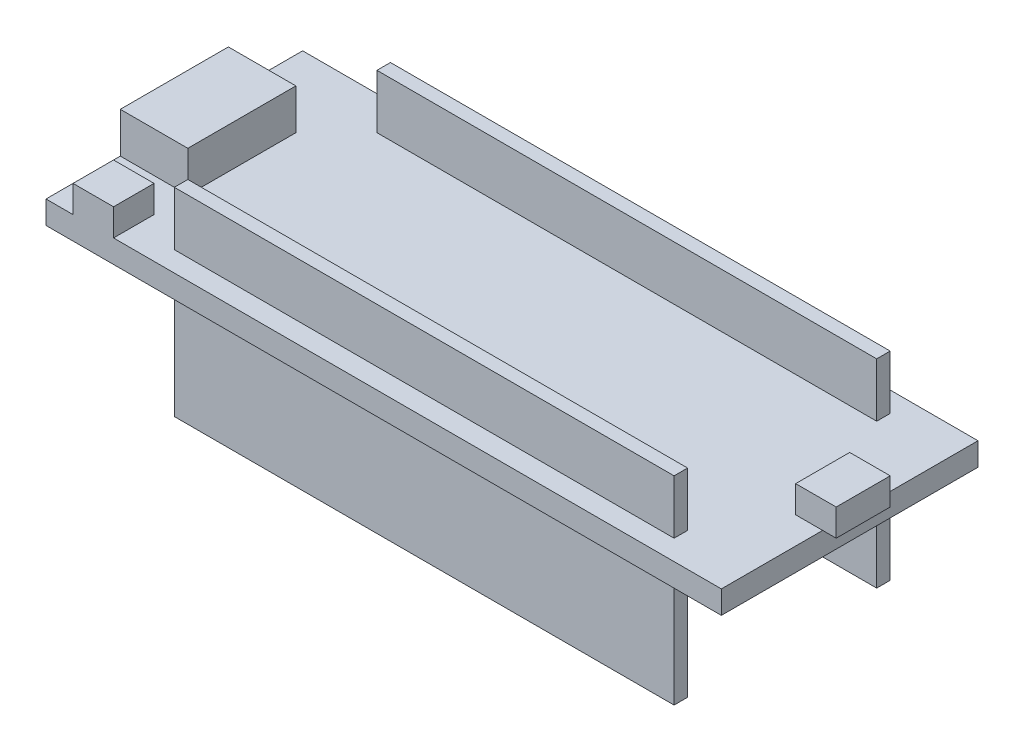
ISO-10303-21;
HEADER;
FILE_DESCRIPTION(('STEP AP214'),'2;1');
FILE_NAME('part.step','',(''),(''),'','','');
FILE_SCHEMA(('AUTOMOTIVE_DESIGN { 1 0 10303 214 1 1 1 1 }'));
ENDSEC;
DATA;
#1=APPLICATION_CONTEXT('core data for automotive mechanical design processes');
#2=APPLICATION_PROTOCOL_DEFINITION('international standard','automotive_design',2000,#1);
#3=PRODUCT_CONTEXT('',#1,'mechanical');
#4=PRODUCT('Part','Part','',(#3));
#5=PRODUCT_RELATED_PRODUCT_CATEGORY('part','',(#4));
#6=PRODUCT_DEFINITION_FORMATION('','',#4);
#7=PRODUCT_DEFINITION_CONTEXT('part definition',#1,'design');
#8=PRODUCT_DEFINITION('design','',#6,#7);
#9=PRODUCT_DEFINITION_SHAPE('','',#8);
#10=(LENGTH_UNIT() NAMED_UNIT(*) SI_UNIT(.MILLI.,.METRE.));
#11=(NAMED_UNIT(*) PLANE_ANGLE_UNIT() SI_UNIT($,.RADIAN.));
#12=(NAMED_UNIT(*) SI_UNIT($,.STERADIAN.) SOLID_ANGLE_UNIT());
#13=UNCERTAINTY_MEASURE_WITH_UNIT(LENGTH_MEASURE(1.E-05),#10,'distance_accuracy_value','');
#14=(GEOMETRIC_REPRESENTATION_CONTEXT(3) GLOBAL_UNCERTAINTY_ASSIGNED_CONTEXT((#13)) GLOBAL_UNIT_ASSIGNED_CONTEXT((#10,
#11,#12)) REPRESENTATION_CONTEXT('',''));
#15=CARTESIAN_POINT('',(0.,0.,0.));
#16=DIRECTION('',(0.,0.,1.));
#17=DIRECTION('',(1.,0.,0.));
#18=AXIS2_PLACEMENT_3D('',#15,#16,#17);
#19=CARTESIAN_POINT('',(0.,1.7,0.));
#20=DIRECTION('',(0.,-1.,0.));
#21=DIRECTION('',(0.,0.,-1.));
#22=AXIS2_PLACEMENT_3D('',#19,#20,#21);
#23=PLANE('',#22);
#24=DIRECTION('',(0.,0.,1.));
#25=VECTOR('',#24,1.);
#26=CARTESIAN_POINT('',(20.,1.7,0.));
#27=LINE('',#26,#25);
#28=CARTESIAN_POINT('',(20.,1.7,7.));
#29=VERTEX_POINT('',#28);
#30=CARTESIAN_POINT('',(20.,1.7,8.));
#31=VERTEX_POINT('',#30);
#32=EDGE_CURVE('E406',#29,#31,#27,.T.);
#33=ORIENTED_EDGE('',*,*,#32,.T.);
#34=DIRECTION('',(-1.,0.,0.));
#35=VECTOR('',#34,1.);
#36=CARTESIAN_POINT('',(0.,1.7,8.));
#37=LINE('',#36,#35);
#38=CARTESIAN_POINT('',(-17.,1.7,8.));
#39=VERTEX_POINT('',#38);
#40=EDGE_CURVE('E427',#31,#39,#37,.T.);
#41=ORIENTED_EDGE('',*,*,#40,.T.);
#42=DIRECTION('',(0.,0.,-1.));
#43=VECTOR('',#42,1.);
#44=CARTESIAN_POINT('',(-17.0000000000001,1.7,1.17961196366423E-13));
#45=LINE('',#44,#43);
#46=CARTESIAN_POINT('',(-17.,1.7,7.));
#47=VERTEX_POINT('',#46);
#48=EDGE_CURVE('E424',#39,#47,#45,.T.);
#49=ORIENTED_EDGE('',*,*,#48,.T.);
#50=DIRECTION('',(1.,0.,0.));
#51=VECTOR('',#50,1.);
#52=CARTESIAN_POINT('',(0.,1.7,7.));
#53=LINE('',#52,#51);
#54=EDGE_CURVE('E421',#47,#29,#53,.T.);
#55=ORIENTED_EDGE('',*,*,#54,.T.);
#56=EDGE_LOOP('',(#33,#41,#49,#55));
#57=FACE_BOUND('',#56,.T.);
#58=DIRECTION('',(1.,0.,0.));
#59=VECTOR('',#58,1.);
#60=CARTESIAN_POINT('',(0.,1.7,-8.));
#61=LINE('',#60,#59);
#62=CARTESIAN_POINT('',(-17.,1.7,-8.));
#63=VERTEX_POINT('',#62);
#64=CARTESIAN_POINT('',(20.,1.7,-8.));
#65=VERTEX_POINT('',#64);
#66=EDGE_CURVE('E354',#63,#65,#61,.T.);
#67=ORIENTED_EDGE('',*,*,#66,.T.);
#68=DIRECTION('',(0.,0.,1.));
#69=VECTOR('',#68,1.);
#70=CARTESIAN_POINT('',(20.,1.7,0.));
#71=LINE('',#70,#69);
#72=CARTESIAN_POINT('',(20.,1.7,-7.));
#73=VERTEX_POINT('',#72);
#74=EDGE_CURVE('E375',#65,#73,#71,.T.);
#75=ORIENTED_EDGE('',*,*,#74,.T.);
#76=DIRECTION('',(-1.,0.,0.));
#77=VECTOR('',#76,1.);
#78=CARTESIAN_POINT('',(0.,1.7,-7.));
#79=LINE('',#78,#77);
#80=CARTESIAN_POINT('',(-17.,1.7,-7.));
#81=VERTEX_POINT('',#80);
#82=EDGE_CURVE('E372',#73,#81,#79,.T.);
#83=ORIENTED_EDGE('',*,*,#82,.T.);
#84=DIRECTION('',(0.,0.,-1.));
#85=VECTOR('',#84,1.);
#86=CARTESIAN_POINT('',(-17.0000000000001,1.7,-1.17961196366423E-13));
#87=LINE('',#86,#85);
#88=EDGE_CURVE('E369',#81,#63,#87,.T.);
#89=ORIENTED_EDGE('',*,*,#88,.T.);
#90=EDGE_LOOP('',(#67,#75,#83,#89));
#91=FACE_BOUND('',#90,.T.);
#92=DIRECTION('',(1.,0.,0.));
#93=VECTOR('',#92,1.);
#94=CARTESIAN_POINT('',(26.,1.7,2.));
#95=LINE('',#94,#93);
#96=CARTESIAN_POINT('',(23.,1.7,2.));
#97=VERTEX_POINT('',#96);
#98=CARTESIAN_POINT('',(25.,1.7,2.));
#99=VERTEX_POINT('',#98);
#100=EDGE_CURVE('E49',#97,#99,#95,.T.);
#101=ORIENTED_EDGE('',*,*,#100,.F.);
#102=DIRECTION('',(0.,0.,1.));
#103=VECTOR('',#102,1.);
#104=CARTESIAN_POINT('',(23.,1.7,2.));
#105=LINE('',#104,#103);
#106=CARTESIAN_POINT('',(23.,1.7,-2.));
#107=VERTEX_POINT('',#106);
#108=EDGE_CURVE('E54',#107,#97,#105,.T.);
#109=ORIENTED_EDGE('',*,*,#108,.F.);
#110=DIRECTION('',(-1.,0.,0.));
#111=VECTOR('',#110,1.);
#112=CARTESIAN_POINT('',(26.,1.7,-2.));
#113=LINE('',#112,#111);
#114=CARTESIAN_POINT('',(25.,1.7,-2.));
#115=VERTEX_POINT('',#114);
#116=EDGE_CURVE('E642',#115,#107,#113,.T.);
#117=ORIENTED_EDGE('',*,*,#116,.F.);
#118=DIRECTION('',(0.,0.,-1.));
#119=VECTOR('',#118,1.);
#120=CARTESIAN_POINT('',(25.,1.7,9.5));
#121=LINE('',#120,#119);
#122=CARTESIAN_POINT('',(25.,1.7,-9.5));
#123=VERTEX_POINT('',#122);
#124=EDGE_CURVE('E495',#115,#123,#121,.T.);
#125=ORIENTED_EDGE('',*,*,#124,.T.);
#126=DIRECTION('',(-1.,0.,0.));
#127=VECTOR('',#126,1.);
#128=CARTESIAN_POINT('',(-25.,1.7,-9.5));
#129=LINE('',#128,#127);
#130=CARTESIAN_POINT('',(-25.,1.7,-9.5));
#131=VERTEX_POINT('',#130);
#132=EDGE_CURVE('E493',#123,#131,#129,.T.);
#133=ORIENTED_EDGE('',*,*,#132,.T.);
#134=DIRECTION('',(0.,0.,1.));
#135=VECTOR('',#134,1.);
#136=CARTESIAN_POINT('',(-25.,1.7,9.5));
#137=LINE('',#136,#135);
#138=CARTESIAN_POINT('',(-25.,1.7,-3.99999999999999));
#139=VERTEX_POINT('',#138);
#140=EDGE_CURVE('E498',#131,#139,#137,.T.);
#141=ORIENTED_EDGE('',*,*,#140,.T.);
#142=DIRECTION('',(-1.,0.,0.));
#143=VECTOR('',#142,1.);
#144=CARTESIAN_POINT('',(-20.,1.7,-3.99999999999999));
#145=LINE('',#144,#143);
#146=CARTESIAN_POINT('',(-20.,1.7,-3.99999999999999));
#147=VERTEX_POINT('',#146);
#148=EDGE_CURVE('E465',#147,#139,#145,.T.);
#149=ORIENTED_EDGE('',*,*,#148,.F.);
#150=DIRECTION('',(0.,0.,-1.));
#151=VECTOR('',#150,1.);
#152=CARTESIAN_POINT('',(-20.,1.7,-3.99999999999999));
#153=LINE('',#152,#151);
#154=CARTESIAN_POINT('',(-20.,1.7,4.00000000000001));
#155=VERTEX_POINT('',#154);
#156=EDGE_CURVE('E474',#155,#147,#153,.T.);
#157=ORIENTED_EDGE('',*,*,#156,.F.);
#158=DIRECTION('',(1.,0.,0.));
#159=VECTOR('',#158,1.);
#160=CARTESIAN_POINT('',(-20.,1.7,4.00000000000001));
#161=LINE('',#160,#159);
#162=CARTESIAN_POINT('',(-25.,1.7,4.00000000000001));
#163=VERTEX_POINT('',#162);
#164=EDGE_CURVE('E460',#163,#155,#161,.T.);
#165=ORIENTED_EDGE('',*,*,#164,.F.);
#166=CARTESIAN_POINT('',(-25.,1.7,9.5));
#167=VERTEX_POINT('',#166);
#168=EDGE_CURVE('E497',#163,#167,#137,.T.);
#169=ORIENTED_EDGE('',*,*,#168,.T.);
#170=DIRECTION('',(1.,0.,0.));
#171=VECTOR('',#170,1.);
#172=CARTESIAN_POINT('',(-25.,1.7,9.5));
#173=LINE('',#172,#171);
#174=CARTESIAN_POINT('',(-23.,1.7,9.5));
#175=VERTEX_POINT('',#174);
#176=EDGE_CURVE('E501',#167,#175,#173,.T.);
#177=ORIENTED_EDGE('',*,*,#176,.T.);
#178=DIRECTION('',(0.,0.,1.));
#179=VECTOR('',#178,1.);
#180=CARTESIAN_POINT('',(-23.,1.7,9.5));
#181=LINE('',#180,#179);
#182=CARTESIAN_POINT('',(-23.,1.7,6.5));
#183=VERTEX_POINT('',#182);
#184=EDGE_CURVE('E435',#183,#175,#181,.T.);
#185=ORIENTED_EDGE('',*,*,#184,.F.);
#186=DIRECTION('',(-1.,0.,0.));
#187=VECTOR('',#186,1.);
#188=CARTESIAN_POINT('',(-20.,1.7,6.5));
#189=LINE('',#188,#187);
#190=CARTESIAN_POINT('',(-20.,1.7,6.5));
#191=VERTEX_POINT('',#190);
#192=EDGE_CURVE('E444',#191,#183,#189,.T.);
#193=ORIENTED_EDGE('',*,*,#192,.F.);
#194=DIRECTION('',(0.,0.,-1.));
#195=VECTOR('',#194,1.);
#196=CARTESIAN_POINT('',(-20.,1.7,9.5));
#197=LINE('',#196,#195);
#198=CARTESIAN_POINT('',(-20.,1.7,9.5));
#199=VERTEX_POINT('',#198);
#200=EDGE_CURVE('E430',#199,#191,#197,.T.);
#201=ORIENTED_EDGE('',*,*,#200,.F.);
#202=CARTESIAN_POINT('',(25.,1.7,9.5));
#203=VERTEX_POINT('',#202);
#204=EDGE_CURVE('E500',#199,#203,#173,.T.);
#205=ORIENTED_EDGE('',*,*,#204,.T.);
#206=EDGE_CURVE('E491',#203,#99,#121,.T.);
#207=ORIENTED_EDGE('',*,*,#206,.T.);
#208=EDGE_LOOP('',(#101,#109,#117,#125,#133,#141,#149,#157,#165,#169,#177,#185,#193,#201,#205,#207));
#209=FACE_BOUND('',#208,.T.);
#210=ADVANCED_FACE('F34',(#57,#91,#209),#23,.F.);
#211=CARTESIAN_POINT('',(0.,0.,0.));
#212=DIRECTION('',(0.,-1.,0.));
#213=DIRECTION('',(0.,0.,-1.));
#214=AXIS2_PLACEMENT_3D('',#211,#212,#213);
#215=PLANE('',#214);
#216=DIRECTION('',(0.,0.,1.));
#217=VECTOR('',#216,1.);
#218=CARTESIAN_POINT('',(20.,0.,0.));
#219=LINE('',#218,#217);
#220=CARTESIAN_POINT('',(20.,0.,-8.));
#221=VERTEX_POINT('',#220);
#222=CARTESIAN_POINT('',(20.,0.,-7.));
#223=VERTEX_POINT('',#222);
#224=EDGE_CURVE('E11',#221,#223,#219,.T.);
#225=ORIENTED_EDGE('',*,*,#224,.F.);
#226=DIRECTION('',(1.,0.,0.));
#227=VECTOR('',#226,1.);
#228=CARTESIAN_POINT('',(0.,0.,-8.));
#229=LINE('',#228,#227);
#230=CARTESIAN_POINT('',(-17.,0.,-8.));
#231=VERTEX_POINT('',#230);
#232=EDGE_CURVE('E537',#231,#221,#229,.T.);
#233=ORIENTED_EDGE('',*,*,#232,.F.);
#234=DIRECTION('',(0.,0.,-1.));
#235=VECTOR('',#234,1.);
#236=CARTESIAN_POINT('',(-17.0000000000001,0.,-1.17961196366423E-13));
#237=LINE('',#236,#235);
#238=CARTESIAN_POINT('',(-17.,0.,-7.));
#239=VERTEX_POINT('',#238);
#240=EDGE_CURVE('E540',#239,#231,#237,.T.);
#241=ORIENTED_EDGE('',*,*,#240,.F.);
#242=DIRECTION('',(-1.,0.,0.));
#243=VECTOR('',#242,1.);
#244=CARTESIAN_POINT('',(0.,0.,-7.));
#245=LINE('',#244,#243);
#246=EDGE_CURVE('E42',#223,#239,#245,.T.);
#247=ORIENTED_EDGE('',*,*,#246,.F.);
#248=EDGE_LOOP('',(#225,#233,#241,#247));
#249=FACE_BOUND('',#248,.T.);
#250=DIRECTION('',(-1.,0.,0.));
#251=VECTOR('',#250,1.);
#252=CARTESIAN_POINT('',(0.,0.,8.));
#253=LINE('',#252,#251);
#254=CARTESIAN_POINT('',(20.,0.,8.));
#255=VERTEX_POINT('',#254);
#256=CARTESIAN_POINT('',(-17.,0.,8.));
#257=VERTEX_POINT('',#256);
#258=EDGE_CURVE('E534',#255,#257,#253,.T.);
#259=ORIENTED_EDGE('',*,*,#258,.F.);
#260=DIRECTION('',(0.,0.,1.));
#261=VECTOR('',#260,1.);
#262=CARTESIAN_POINT('',(20.,0.,0.));
#263=LINE('',#262,#261);
#264=CARTESIAN_POINT('',(20.,0.,7.));
#265=VERTEX_POINT('',#264);
#266=EDGE_CURVE('E525',#265,#255,#263,.T.);
#267=ORIENTED_EDGE('',*,*,#266,.F.);
#268=DIRECTION('',(1.,0.,0.));
#269=VECTOR('',#268,1.);
#270=CARTESIAN_POINT('',(0.,0.,7.));
#271=LINE('',#270,#269);
#272=CARTESIAN_POINT('',(-17.,0.,7.));
#273=VERTEX_POINT('',#272);
#274=EDGE_CURVE('E528',#273,#265,#271,.T.);
#275=ORIENTED_EDGE('',*,*,#274,.F.);
#276=DIRECTION('',(0.,0.,-1.));
#277=VECTOR('',#276,1.);
#278=CARTESIAN_POINT('',(-17.0000000000001,0.,1.17961196366423E-13));
#279=LINE('',#278,#277);
#280=EDGE_CURVE('E531',#257,#273,#279,.T.);
#281=ORIENTED_EDGE('',*,*,#280,.F.);
#282=EDGE_LOOP('',(#259,#267,#275,#281));
#283=FACE_BOUND('',#282,.T.);
#284=DIRECTION('',(0.,0.,1.));
#285=VECTOR('',#284,1.);
#286=CARTESIAN_POINT('',(-22.,0.,-1.));
#287=LINE('',#286,#285);
#288=CARTESIAN_POINT('',(-22.,0.,-1.));
#289=VERTEX_POINT('',#288);
#290=CARTESIAN_POINT('',(-22.,0.,1.));
#291=VERTEX_POINT('',#290);
#292=EDGE_CURVE('E297',#289,#291,#287,.T.);
#293=ORIENTED_EDGE('',*,*,#292,.F.);
#294=DIRECTION('',(1.,0.,0.));
#295=VECTOR('',#294,1.);
#296=CARTESIAN_POINT('',(-22.,0.,-1.));
#297=LINE('',#296,#295);
#298=CARTESIAN_POINT('',(-25.,0.,-1.));
#299=VERTEX_POINT('',#298);
#300=EDGE_CURVE('E295',#299,#289,#297,.T.);
#301=ORIENTED_EDGE('',*,*,#300,.F.);
#302=DIRECTION('',(0.,0.,1.));
#303=VECTOR('',#302,1.);
#304=CARTESIAN_POINT('',(-25.,0.,9.5));
#305=LINE('',#304,#303);
#306=CARTESIAN_POINT('',(-25.,0.,-9.5));
#307=VERTEX_POINT('',#306);
#308=EDGE_CURVE('E509',#307,#299,#305,.T.);
#309=ORIENTED_EDGE('',*,*,#308,.F.);
#310=DIRECTION('',(-1.,0.,0.));
#311=VECTOR('',#310,1.);
#312=CARTESIAN_POINT('',(-25.,0.,-9.5));
#313=LINE('',#312,#311);
#314=CARTESIAN_POINT('',(25.,0.,-9.5));
#315=VERTEX_POINT('',#314);
#316=EDGE_CURVE('E506',#315,#307,#313,.T.);
#317=ORIENTED_EDGE('',*,*,#316,.F.);
#318=DIRECTION('',(0.,0.,-1.));
#319=VECTOR('',#318,1.);
#320=CARTESIAN_POINT('',(25.,0.,9.5));
#321=LINE('',#320,#319);
#322=CARTESIAN_POINT('',(25.,0.,9.5));
#323=VERTEX_POINT('',#322);
#324=EDGE_CURVE('E490',#323,#315,#321,.T.);
#325=ORIENTED_EDGE('',*,*,#324,.F.);
#326=DIRECTION('',(1.,0.,0.));
#327=VECTOR('',#326,1.);
#328=CARTESIAN_POINT('',(-25.,0.,9.5));
#329=LINE('',#328,#327);
#330=CARTESIAN_POINT('',(-25.,0.,9.5));
#331=VERTEX_POINT('',#330);
#332=EDGE_CURVE('E512',#331,#323,#329,.T.);
#333=ORIENTED_EDGE('',*,*,#332,.F.);
#334=CARTESIAN_POINT('',(-25.,0.,1.));
#335=VERTEX_POINT('',#334);
#336=EDGE_CURVE('E508',#335,#331,#305,.T.);
#337=ORIENTED_EDGE('',*,*,#336,.F.);
#338=DIRECTION('',(-1.,0.,0.));
#339=VECTOR('',#338,1.);
#340=CARTESIAN_POINT('',(-22.,0.,1.));
#341=LINE('',#340,#339);
#342=EDGE_CURVE('E307',#291,#335,#341,.T.);
#343=ORIENTED_EDGE('',*,*,#342,.F.);
#344=EDGE_LOOP('',(#293,#301,#309,#317,#325,#333,#337,#343));
#345=FACE_BOUND('',#344,.T.);
#346=ADVANCED_FACE('F556',(#249,#283,#345),#215,.T.);
#347=CARTESIAN_POINT('',(25.,1.7,9.5));
#348=DIRECTION('',(-1.,0.,0.));
#349=DIRECTION('',(0.,0.,1.));
#350=AXIS2_PLACEMENT_3D('',#347,#348,#349);
#351=PLANE('',#350);
#352=ORIENTED_EDGE('',*,*,#324,.T.);
#353=DIRECTION('',(0.,-1.,0.));
#354=VECTOR('',#353,1.);
#355=CARTESIAN_POINT('',(25.,1.7,-9.5));
#356=LINE('',#355,#354);
#357=EDGE_CURVE('E522',#123,#315,#356,.T.);
#358=ORIENTED_EDGE('',*,*,#357,.F.);
#359=ORIENTED_EDGE('',*,*,#124,.F.);
#360=EDGE_CURVE('E494',#99,#115,#121,.T.);
#361=ORIENTED_EDGE('',*,*,#360,.F.);
#362=ORIENTED_EDGE('',*,*,#206,.F.);
#363=DIRECTION('',(0.,-1.,0.));
#364=VECTOR('',#363,1.);
#365=CARTESIAN_POINT('',(25.,1.7,9.5));
#366=LINE('',#365,#364);
#367=EDGE_CURVE('E503',#203,#323,#366,.T.);
#368=ORIENTED_EDGE('',*,*,#367,.T.);
#369=EDGE_LOOP('',(#352,#358,#359,#361,#362,#368));
#370=FACE_BOUND('',#369,.T.);
#371=ADVANCED_FACE('F36',(#370),#351,.F.);
#372=CARTESIAN_POINT('',(-25.,1.7,-9.5));
#373=DIRECTION('',(0.,0.,1.));
#374=DIRECTION('',(1.,0.,0.));
#375=AXIS2_PLACEMENT_3D('',#372,#373,#374);
#376=PLANE('',#375);
#377=ORIENTED_EDGE('',*,*,#316,.T.);
#378=DIRECTION('',(0.,-1.,0.));
#379=VECTOR('',#378,1.);
#380=CARTESIAN_POINT('',(-25.,1.7,-9.5));
#381=LINE('',#380,#379);
#382=EDGE_CURVE('E519',#131,#307,#381,.T.);
#383=ORIENTED_EDGE('',*,*,#382,.F.);
#384=ORIENTED_EDGE('',*,*,#132,.F.);
#385=ORIENTED_EDGE('',*,*,#357,.T.);
#386=EDGE_LOOP('',(#377,#383,#384,#385));
#387=FACE_BOUND('',#386,.T.);
#388=ADVANCED_FACE('F593',(#387),#376,.F.);
#389=CARTESIAN_POINT('',(-25.,1.7,9.5));
#390=DIRECTION('',(1.,0.,0.));
#391=DIRECTION('',(0.,0.,-1.));
#392=AXIS2_PLACEMENT_3D('',#389,#390,#391);
#393=PLANE('',#392);
#394=ORIENTED_EDGE('',*,*,#308,.T.);
#395=DIRECTION('',(0.,1.,0.));
#396=VECTOR('',#395,1.);
#397=CARTESIAN_POINT('',(-25.,-1.,-1.));
#398=LINE('',#397,#396);
#399=CARTESIAN_POINT('',(-25.,-1.,-1.));
#400=VERTEX_POINT('',#399);
#401=EDGE_CURVE('E324',#400,#299,#398,.T.);
#402=ORIENTED_EDGE('',*,*,#401,.F.);
#403=DIRECTION('',(0.,0.,-1.));
#404=VECTOR('',#403,1.);
#405=CARTESIAN_POINT('',(-25.,-1.,-1.));
#406=LINE('',#405,#404);
#407=CARTESIAN_POINT('',(-25.,-1.,1.));
#408=VERTEX_POINT('',#407);
#409=EDGE_CURVE('E303',#408,#400,#406,.T.);
#410=ORIENTED_EDGE('',*,*,#409,.F.);
#411=DIRECTION('',(0.,1.,0.));
#412=VECTOR('',#411,1.);
#413=CARTESIAN_POINT('',(-25.,-1.,1.));
#414=LINE('',#413,#412);
#415=EDGE_CURVE('E312',#408,#335,#414,.T.);
#416=ORIENTED_EDGE('',*,*,#415,.T.);
#417=ORIENTED_EDGE('',*,*,#336,.T.);
#418=DIRECTION('',(0.,-1.,0.));
#419=VECTOR('',#418,1.);
#420=CARTESIAN_POINT('',(-25.,1.7,9.5));
#421=LINE('',#420,#419);
#422=EDGE_CURVE('E516',#167,#331,#421,.T.);
#423=ORIENTED_EDGE('',*,*,#422,.F.);
#424=ORIENTED_EDGE('',*,*,#168,.F.);
#425=DIRECTION('',(0.,-1.,0.));
#426=VECTOR('',#425,1.);
#427=CARTESIAN_POINT('',(-25.,4.7,4.00000000000001));
#428=LINE('',#427,#426);
#429=CARTESIAN_POINT('',(-25.,4.7,4.00000000000001));
#430=VERTEX_POINT('',#429);
#431=EDGE_CURVE('E487',#430,#163,#428,.T.);
#432=ORIENTED_EDGE('',*,*,#431,.F.);
#433=DIRECTION('',(0.,0.,1.));
#434=VECTOR('',#433,1.);
#435=CARTESIAN_POINT('',(-25.,4.7,-3.99999999999999));
#436=LINE('',#435,#434);
#437=CARTESIAN_POINT('',(-25.,4.7,-3.99999999999999));
#438=VERTEX_POINT('',#437);
#439=EDGE_CURVE('E461',#438,#430,#436,.T.);
#440=ORIENTED_EDGE('',*,*,#439,.F.);
#441=DIRECTION('',(0.,-1.,0.));
#442=VECTOR('',#441,1.);
#443=CARTESIAN_POINT('',(-25.,4.7,-3.99999999999999));
#444=LINE('',#443,#442);
#445=EDGE_CURVE('E471',#438,#139,#444,.T.);
#446=ORIENTED_EDGE('',*,*,#445,.T.);
#447=ORIENTED_EDGE('',*,*,#140,.F.);
#448=ORIENTED_EDGE('',*,*,#382,.T.);
#449=EDGE_LOOP('',(#394,#402,#410,#416,#417,#423,#424,#432,#440,#446,#447,#448));
#450=FACE_BOUND('',#449,.T.);
#451=ADVANCED_FACE('F590',(#450),#393,.F.);
#452=CARTESIAN_POINT('',(-25.,1.7,9.5));
#453=DIRECTION('',(0.,0.,-1.));
#454=DIRECTION('',(-1.,0.,0.));
#455=AXIS2_PLACEMENT_3D('',#452,#453,#454);
#456=PLANE('',#455);
#457=ORIENTED_EDGE('',*,*,#332,.T.);
#458=ORIENTED_EDGE('',*,*,#367,.F.);
#459=ORIENTED_EDGE('',*,*,#204,.F.);
#460=DIRECTION('',(0.,-1.,0.));
#461=VECTOR('',#460,1.);
#462=CARTESIAN_POINT('',(-20.,3.7,9.5));
#463=LINE('',#462,#461);
#464=CARTESIAN_POINT('',(-20.,3.7,9.5));
#465=VERTEX_POINT('',#464);
#466=EDGE_CURVE('E441',#465,#199,#463,.T.);
#467=ORIENTED_EDGE('',*,*,#466,.F.);
#468=DIRECTION('',(1.,0.,0.));
#469=VECTOR('',#468,1.);
#470=CARTESIAN_POINT('',(-20.,3.7,9.5));
#471=LINE('',#470,#469);
#472=CARTESIAN_POINT('',(-23.,3.7,9.5));
#473=VERTEX_POINT('',#472);
#474=EDGE_CURVE('E439',#473,#465,#471,.T.);
#475=ORIENTED_EDGE('',*,*,#474,.F.);
#476=DIRECTION('',(0.,-1.,0.));
#477=VECTOR('',#476,1.);
#478=CARTESIAN_POINT('',(-23.,3.7,9.5));
#479=LINE('',#478,#477);
#480=EDGE_CURVE('E451',#473,#175,#479,.T.);
#481=ORIENTED_EDGE('',*,*,#480,.T.);
#482=ORIENTED_EDGE('',*,*,#176,.F.);
#483=ORIENTED_EDGE('',*,*,#422,.T.);
#484=EDGE_LOOP('',(#457,#458,#459,#467,#475,#481,#482,#483));
#485=FACE_BOUND('',#484,.T.);
#486=ADVANCED_FACE('F587',(#485),#456,.F.);
#487=CARTESIAN_POINT('',(-20.,4.7,4.00000000000001));
#488=DIRECTION('',(0.,0.,-1.));
#489=DIRECTION('',(-1.,0.,0.));
#490=AXIS2_PLACEMENT_3D('',#487,#488,#489);
#491=PLANE('',#490);
#492=ORIENTED_EDGE('',*,*,#164,.T.);
#493=DIRECTION('',(0.,-1.,0.));
#494=VECTOR('',#493,1.);
#495=CARTESIAN_POINT('',(-20.,4.7,4.00000000000001));
#496=LINE('',#495,#494);
#497=CARTESIAN_POINT('',(-20.,4.7,4.00000000000001));
#498=VERTEX_POINT('',#497);
#499=EDGE_CURVE('E484',#498,#155,#496,.T.);
#500=ORIENTED_EDGE('',*,*,#499,.F.);
#501=DIRECTION('',(1.,0.,0.));
#502=VECTOR('',#501,1.);
#503=CARTESIAN_POINT('',(-20.,4.7,4.00000000000001));
#504=LINE('',#503,#502);
#505=EDGE_CURVE('E464',#430,#498,#504,.T.);
#506=ORIENTED_EDGE('',*,*,#505,.F.);
#507=ORIENTED_EDGE('',*,*,#431,.T.);
#508=EDGE_LOOP('',(#492,#500,#506,#507));
#509=FACE_BOUND('',#508,.T.);
#510=ADVANCED_FACE('F584',(#509),#491,.F.);
#511=CARTESIAN_POINT('',(-20.,4.7,-3.99999999999999));
#512=DIRECTION('',(-1.,0.,0.));
#513=DIRECTION('',(0.,0.,1.));
#514=AXIS2_PLACEMENT_3D('',#511,#512,#513);
#515=PLANE('',#514);
#516=ORIENTED_EDGE('',*,*,#156,.T.);
#517=DIRECTION('',(0.,-1.,0.));
#518=VECTOR('',#517,1.);
#519=CARTESIAN_POINT('',(-20.,4.7,-3.99999999999999));
#520=LINE('',#519,#518);
#521=CARTESIAN_POINT('',(-20.,4.7,-3.99999999999999));
#522=VERTEX_POINT('',#521);
#523=EDGE_CURVE('E481',#522,#147,#520,.T.);
#524=ORIENTED_EDGE('',*,*,#523,.F.);
#525=DIRECTION('',(0.,0.,-1.));
#526=VECTOR('',#525,1.);
#527=CARTESIAN_POINT('',(-20.,4.7,-3.99999999999999));
#528=LINE('',#527,#526);
#529=EDGE_CURVE('E467',#498,#522,#528,.T.);
#530=ORIENTED_EDGE('',*,*,#529,.F.);
#531=ORIENTED_EDGE('',*,*,#499,.T.);
#532=EDGE_LOOP('',(#516,#524,#530,#531));
#533=FACE_BOUND('',#532,.T.);
#534=ADVANCED_FACE('F754',(#533),#515,.F.);
#535=CARTESIAN_POINT('',(-20.,4.7,-3.99999999999999));
#536=DIRECTION('',(0.,0.,1.));
#537=DIRECTION('',(1.,0.,0.));
#538=AXIS2_PLACEMENT_3D('',#535,#536,#537);
#539=PLANE('',#538);
#540=ORIENTED_EDGE('',*,*,#148,.T.);
#541=ORIENTED_EDGE('',*,*,#445,.F.);
#542=DIRECTION('',(-1.,0.,0.));
#543=VECTOR('',#542,1.);
#544=CARTESIAN_POINT('',(-20.,4.7,-3.99999999999999));
#545=LINE('',#544,#543);
#546=EDGE_CURVE('E469',#522,#438,#545,.T.);
#547=ORIENTED_EDGE('',*,*,#546,.F.);
#548=ORIENTED_EDGE('',*,*,#523,.T.);
#549=EDGE_LOOP('',(#540,#541,#547,#548));
#550=FACE_BOUND('',#549,.T.);
#551=ADVANCED_FACE('F751',(#550),#539,.F.);
#552=CARTESIAN_POINT('',(0.,4.7,0.));
#553=DIRECTION('',(0.,-1.,0.));
#554=DIRECTION('',(0.,0.,-1.));
#555=AXIS2_PLACEMENT_3D('',#552,#553,#554);
#556=PLANE('',#555);
#557=ORIENTED_EDGE('',*,*,#439,.T.);
#558=ORIENTED_EDGE('',*,*,#505,.T.);
#559=ORIENTED_EDGE('',*,*,#529,.T.);
#560=ORIENTED_EDGE('',*,*,#546,.T.);
#561=EDGE_LOOP('',(#557,#558,#559,#560));
#562=FACE_BOUND('',#561,.T.);
#563=ADVANCED_FACE('F747',(#562),#556,.F.);
#564=CARTESIAN_POINT('',(-20.,3.7,9.5));
#565=DIRECTION('',(-1.,0.,0.));
#566=DIRECTION('',(0.,0.,1.));
#567=AXIS2_PLACEMENT_3D('',#564,#565,#566);
#568=PLANE('',#567);
#569=ORIENTED_EDGE('',*,*,#200,.T.);
#570=DIRECTION('',(0.,-1.,0.));
#571=VECTOR('',#570,1.);
#572=CARTESIAN_POINT('',(-20.,3.7,6.5));
#573=LINE('',#572,#571);
#574=CARTESIAN_POINT('',(-20.,3.7,6.5));
#575=VERTEX_POINT('',#574);
#576=EDGE_CURVE('E457',#575,#191,#573,.T.);
#577=ORIENTED_EDGE('',*,*,#576,.F.);
#578=DIRECTION('',(0.,0.,-1.));
#579=VECTOR('',#578,1.);
#580=CARTESIAN_POINT('',(-20.,3.7,9.5));
#581=LINE('',#580,#579);
#582=EDGE_CURVE('E431',#465,#575,#581,.T.);
#583=ORIENTED_EDGE('',*,*,#582,.F.);
#584=ORIENTED_EDGE('',*,*,#466,.T.);
#585=EDGE_LOOP('',(#569,#577,#583,#584));
#586=FACE_BOUND('',#585,.T.);
#587=ADVANCED_FACE('F743',(#586),#568,.F.);
#588=CARTESIAN_POINT('',(-20.,3.7,6.5));
#589=DIRECTION('',(0.,0.,1.));
#590=DIRECTION('',(1.,0.,0.));
#591=AXIS2_PLACEMENT_3D('',#588,#589,#590);
#592=PLANE('',#591);
#593=ORIENTED_EDGE('',*,*,#192,.T.);
#594=DIRECTION('',(0.,-1.,0.));
#595=VECTOR('',#594,1.);
#596=CARTESIAN_POINT('',(-23.,3.7,6.5));
#597=LINE('',#596,#595);
#598=CARTESIAN_POINT('',(-23.,3.7,6.5));
#599=VERTEX_POINT('',#598);
#600=EDGE_CURVE('E454',#599,#183,#597,.T.);
#601=ORIENTED_EDGE('',*,*,#600,.F.);
#602=DIRECTION('',(-1.,0.,0.));
#603=VECTOR('',#602,1.);
#604=CARTESIAN_POINT('',(-20.,3.7,6.5));
#605=LINE('',#604,#603);
#606=EDGE_CURVE('E434',#575,#599,#605,.T.);
#607=ORIENTED_EDGE('',*,*,#606,.F.);
#608=ORIENTED_EDGE('',*,*,#576,.T.);
#609=EDGE_LOOP('',(#593,#601,#607,#608));
#610=FACE_BOUND('',#609,.T.);
#611=ADVANCED_FACE('F739',(#610),#592,.F.);
#612=CARTESIAN_POINT('',(-23.,3.7,9.5));
#613=DIRECTION('',(1.,0.,0.));
#614=DIRECTION('',(0.,0.,-1.));
#615=AXIS2_PLACEMENT_3D('',#612,#613,#614);
#616=PLANE('',#615);
#617=ORIENTED_EDGE('',*,*,#184,.T.);
#618=ORIENTED_EDGE('',*,*,#480,.F.);
#619=DIRECTION('',(0.,0.,1.));
#620=VECTOR('',#619,1.);
#621=CARTESIAN_POINT('',(-23.,3.7,9.5));
#622=LINE('',#621,#620);
#623=EDGE_CURVE('E437',#599,#473,#622,.T.);
#624=ORIENTED_EDGE('',*,*,#623,.F.);
#625=ORIENTED_EDGE('',*,*,#600,.T.);
#626=EDGE_LOOP('',(#617,#618,#624,#625));
#627=FACE_BOUND('',#626,.T.);
#628=ADVANCED_FACE('F735',(#627),#616,.F.);
#629=CARTESIAN_POINT('',(0.,3.7,0.));
#630=DIRECTION('',(0.,1.,0.));
#631=DIRECTION('',(0.,0.,1.));
#632=AXIS2_PLACEMENT_3D('',#629,#630,#631);
#633=PLANE('',#632);
#634=ORIENTED_EDGE('',*,*,#582,.T.);
#635=ORIENTED_EDGE('',*,*,#606,.T.);
#636=ORIENTED_EDGE('',*,*,#623,.T.);
#637=ORIENTED_EDGE('',*,*,#474,.T.);
#638=EDGE_LOOP('',(#634,#635,#636,#637));
#639=FACE_BOUND('',#638,.T.);
#640=ADVANCED_FACE('F713',(#639),#633,.T.);
#641=CARTESIAN_POINT('',(0.,-9.,0.));
#642=DIRECTION('',(0.,-1.,0.));
#643=DIRECTION('',(0.,0.,-1.));
#644=AXIS2_PLACEMENT_3D('',#641,#642,#643);
#645=PLANE('',#644);
#646=DIRECTION('',(1.,0.,0.));
#647=VECTOR('',#646,1.);
#648=CARTESIAN_POINT('',(20.,-9.,8.));
#649=LINE('',#648,#647);
#650=CARTESIAN_POINT('',(-17.,-9.,8.));
#651=VERTEX_POINT('',#650);
#652=CARTESIAN_POINT('',(20.,-9.,8.));
#653=VERTEX_POINT('',#652);
#654=EDGE_CURVE('E390',#651,#653,#649,.T.);
#655=ORIENTED_EDGE('',*,*,#654,.F.);
#656=DIRECTION('',(0.,0.,1.));
#657=VECTOR('',#656,1.);
#658=CARTESIAN_POINT('',(-17.,-9.,8.));
#659=LINE('',#658,#657);
#660=CARTESIAN_POINT('',(-17.,-9.,7.));
#661=VERTEX_POINT('',#660);
#662=EDGE_CURVE('E399',#661,#651,#659,.T.);
#663=ORIENTED_EDGE('',*,*,#662,.F.);
#664=DIRECTION('',(-1.,0.,0.));
#665=VECTOR('',#664,1.);
#666=CARTESIAN_POINT('',(20.,-9.,7.));
#667=LINE('',#666,#665);
#668=CARTESIAN_POINT('',(20.,-9.,7.));
#669=VERTEX_POINT('',#668);
#670=EDGE_CURVE('E396',#669,#661,#667,.T.);
#671=ORIENTED_EDGE('',*,*,#670,.F.);
#672=DIRECTION('',(0.,0.,-1.));
#673=VECTOR('',#672,1.);
#674=CARTESIAN_POINT('',(20.,-9.,8.));
#675=LINE('',#674,#673);
#676=EDGE_CURVE('E393',#653,#669,#675,.T.);
#677=ORIENTED_EDGE('',*,*,#676,.F.);
#678=EDGE_LOOP('',(#655,#663,#671,#677));
#679=FACE_BOUND('',#678,.T.);
#680=ADVANCED_FACE('F709',(#679),#645,.T.);
#681=CARTESIAN_POINT('',(20.,-9.,8.));
#682=DIRECTION('',(1.,0.,0.));
#683=DIRECTION('',(0.,0.,-1.));
#684=AXIS2_PLACEMENT_3D('',#681,#682,#683);
#685=PLANE('',#684);
#686=DIRECTION('',(0.,1.,0.));
#687=VECTOR('',#686,1.);
#688=CARTESIAN_POINT('',(20.,-9.,7.));
#689=LINE('',#688,#687);
#690=EDGE_CURVE('E412',#669,#265,#689,.T.);
#691=ORIENTED_EDGE('',*,*,#690,.T.);
#692=ORIENTED_EDGE('',*,*,#266,.T.);
#693=DIRECTION('',(0.,1.,0.));
#694=VECTOR('',#693,1.);
#695=CARTESIAN_POINT('',(20.,-9.,8.));
#696=LINE('',#695,#694);
#697=EDGE_CURVE('E416',#653,#255,#696,.T.);
#698=ORIENTED_EDGE('',*,*,#697,.F.);
#699=ORIENTED_EDGE('',*,*,#676,.T.);
#700=EDGE_LOOP('',(#691,#692,#698,#699));
#701=FACE_BOUND('',#700,.T.);
#702=ADVANCED_FACE('F712',(#701),#685,.T.);
#703=CARTESIAN_POINT('',(20.,-9.,7.));
#704=DIRECTION('',(0.,0.,-1.));
#705=DIRECTION('',(-1.,0.,0.));
#706=AXIS2_PLACEMENT_3D('',#703,#704,#705);
#707=PLANE('',#706);
#708=DIRECTION('',(0.,1.,0.));
#709=VECTOR('',#708,1.);
#710=CARTESIAN_POINT('',(-17.,-9.,7.));
#711=LINE('',#710,#709);
#712=EDGE_CURVE('E408',#661,#273,#711,.T.);
#713=ORIENTED_EDGE('',*,*,#712,.T.);
#714=ORIENTED_EDGE('',*,*,#274,.T.);
#715=ORIENTED_EDGE('',*,*,#690,.F.);
#716=ORIENTED_EDGE('',*,*,#670,.T.);
#717=EDGE_LOOP('',(#713,#714,#715,#716));
#718=FACE_BOUND('',#717,.T.);
#719=ADVANCED_FACE('F719',(#718),#707,.T.);
#720=CARTESIAN_POINT('',(-17.,-9.,8.));
#721=DIRECTION('',(-1.,0.,0.));
#722=DIRECTION('',(0.,0.,1.));
#723=AXIS2_PLACEMENT_3D('',#720,#721,#722);
#724=PLANE('',#723);
#725=DIRECTION('',(0.,1.,0.));
#726=VECTOR('',#725,1.);
#727=CARTESIAN_POINT('',(-17.,-9.,8.));
#728=LINE('',#727,#726);
#729=EDGE_CURVE('E403',#651,#257,#728,.T.);
#730=ORIENTED_EDGE('',*,*,#729,.T.);
#731=ORIENTED_EDGE('',*,*,#280,.T.);
#732=ORIENTED_EDGE('',*,*,#712,.F.);
#733=ORIENTED_EDGE('',*,*,#662,.T.);
#734=EDGE_LOOP('',(#730,#731,#732,#733));
#735=FACE_BOUND('',#734,.T.);
#736=ADVANCED_FACE('F715',(#735),#724,.T.);
#737=CARTESIAN_POINT('',(20.,-9.,8.));
#738=DIRECTION('',(0.,0.,1.));
#739=DIRECTION('',(1.,0.,0.));
#740=AXIS2_PLACEMENT_3D('',#737,#738,#739);
#741=PLANE('',#740);
#742=ORIENTED_EDGE('',*,*,#697,.T.);
#743=ORIENTED_EDGE('',*,*,#258,.T.);
#744=ORIENTED_EDGE('',*,*,#729,.F.);
#745=ORIENTED_EDGE('',*,*,#654,.T.);
#746=EDGE_LOOP('',(#742,#743,#744,#745));
#747=FACE_BOUND('',#746,.T.);
#748=ADVANCED_FACE('F718',(#747),#741,.T.);
#749=ORIENTED_EDGE('',*,*,#40,.F.);
#750=CARTESIAN_POINT('',(20.,5.7,8.));
#751=VERTEX_POINT('',#750);
#752=EDGE_CURVE('E402',#31,#751,#696,.T.);
#753=ORIENTED_EDGE('',*,*,#752,.T.);
#754=DIRECTION('',(1.,0.,0.));
#755=VECTOR('',#754,1.);
#756=CARTESIAN_POINT('',(20.,5.7,8.));
#757=LINE('',#756,#755);
#758=CARTESIAN_POINT('',(-17.,5.7,8.));
#759=VERTEX_POINT('',#758);
#760=EDGE_CURVE('E378',#759,#751,#757,.T.);
#761=ORIENTED_EDGE('',*,*,#760,.F.);
#762=EDGE_CURVE('E407',#39,#759,#728,.T.);
#763=ORIENTED_EDGE('',*,*,#762,.F.);
#764=EDGE_LOOP('',(#749,#753,#761,#763));
#765=FACE_BOUND('',#764,.T.);
#766=ADVANCED_FACE('F731',(#765),#741,.T.);
#767=ORIENTED_EDGE('',*,*,#48,.F.);
#768=ORIENTED_EDGE('',*,*,#762,.T.);
#769=DIRECTION('',(0.,0.,1.));
#770=VECTOR('',#769,1.);
#771=CARTESIAN_POINT('',(-17.,5.7,8.));
#772=LINE('',#771,#770);
#773=CARTESIAN_POINT('',(-17.,5.7,7.));
#774=VERTEX_POINT('',#773);
#775=EDGE_CURVE('E387',#774,#759,#772,.T.);
#776=ORIENTED_EDGE('',*,*,#775,.F.);
#777=EDGE_CURVE('E411',#47,#774,#711,.T.);
#778=ORIENTED_EDGE('',*,*,#777,.F.);
#779=EDGE_LOOP('',(#767,#768,#776,#778));
#780=FACE_BOUND('',#779,.T.);
#781=ADVANCED_FACE('F721',(#780),#724,.T.);
#782=ORIENTED_EDGE('',*,*,#54,.F.);
#783=ORIENTED_EDGE('',*,*,#777,.T.);
#784=DIRECTION('',(-1.,0.,0.));
#785=VECTOR('',#784,1.);
#786=CARTESIAN_POINT('',(20.,5.7,7.));
#787=LINE('',#786,#785);
#788=CARTESIAN_POINT('',(20.,5.7,7.));
#789=VERTEX_POINT('',#788);
#790=EDGE_CURVE('E384',#789,#774,#787,.T.);
#791=ORIENTED_EDGE('',*,*,#790,.F.);
#792=EDGE_CURVE('E415',#29,#789,#689,.T.);
#793=ORIENTED_EDGE('',*,*,#792,.F.);
#794=EDGE_LOOP('',(#782,#783,#791,#793));
#795=FACE_BOUND('',#794,.T.);
#796=ADVANCED_FACE('F725',(#795),#707,.T.);
#797=ORIENTED_EDGE('',*,*,#32,.F.);
#798=ORIENTED_EDGE('',*,*,#792,.T.);
#799=DIRECTION('',(0.,0.,-1.));
#800=VECTOR('',#799,1.);
#801=CARTESIAN_POINT('',(20.,5.7,8.));
#802=LINE('',#801,#800);
#803=EDGE_CURVE('E381',#751,#789,#802,.T.);
#804=ORIENTED_EDGE('',*,*,#803,.F.);
#805=ORIENTED_EDGE('',*,*,#752,.F.);
#806=EDGE_LOOP('',(#797,#798,#804,#805));
#807=FACE_BOUND('',#806,.T.);
#808=ADVANCED_FACE('F707',(#807),#685,.T.);
#809=CARTESIAN_POINT('',(0.,5.7,0.));
#810=DIRECTION('',(0.,-1.,0.));
#811=DIRECTION('',(0.,0.,-1.));
#812=AXIS2_PLACEMENT_3D('',#809,#810,#811);
#813=PLANE('',#812);
#814=ORIENTED_EDGE('',*,*,#760,.T.);
#815=ORIENTED_EDGE('',*,*,#803,.T.);
#816=ORIENTED_EDGE('',*,*,#790,.T.);
#817=ORIENTED_EDGE('',*,*,#775,.T.);
#818=EDGE_LOOP('',(#814,#815,#816,#817));
#819=FACE_BOUND('',#818,.T.);
#820=ADVANCED_FACE('F569',(#819),#813,.F.);
#821=CARTESIAN_POINT('',(0.,-9.,0.));
#822=DIRECTION('',(0.,-1.,0.));
#823=DIRECTION('',(0.,0.,-1.));
#824=AXIS2_PLACEMENT_3D('',#821,#822,#823);
#825=PLANE('',#824);
#826=DIRECTION('',(0.,0.,-1.));
#827=VECTOR('',#826,1.);
#828=CARTESIAN_POINT('',(20.,-9.,-8.));
#829=LINE('',#828,#827);
#830=CARTESIAN_POINT('',(20.,-9.,-7.));
#831=VERTEX_POINT('',#830);
#832=CARTESIAN_POINT('',(20.,-9.,-8.));
#833=VERTEX_POINT('',#832);
#834=EDGE_CURVE('E338',#831,#833,#829,.T.);
#835=ORIENTED_EDGE('',*,*,#834,.F.);
#836=DIRECTION('',(1.,0.,0.));
#837=VECTOR('',#836,1.);
#838=CARTESIAN_POINT('',(20.,-9.,-7.));
#839=LINE('',#838,#837);
#840=CARTESIAN_POINT('',(-17.,-9.,-7.));
#841=VERTEX_POINT('',#840);
#842=EDGE_CURVE('E347',#841,#831,#839,.T.);
#843=ORIENTED_EDGE('',*,*,#842,.F.);
#844=DIRECTION('',(0.,0.,1.));
#845=VECTOR('',#844,1.);
#846=CARTESIAN_POINT('',(-17.,-9.,-8.));
#847=LINE('',#846,#845);
#848=CARTESIAN_POINT('',(-17.,-9.,-8.));
#849=VERTEX_POINT('',#848);
#850=EDGE_CURVE('E344',#849,#841,#847,.T.);
#851=ORIENTED_EDGE('',*,*,#850,.F.);
#852=DIRECTION('',(-1.,0.,0.));
#853=VECTOR('',#852,1.);
#854=CARTESIAN_POINT('',(20.,-9.,-8.));
#855=LINE('',#854,#853);
#856=EDGE_CURVE('E341',#833,#849,#855,.T.);
#857=ORIENTED_EDGE('',*,*,#856,.F.);
#858=EDGE_LOOP('',(#835,#843,#851,#857));
#859=FACE_BOUND('',#858,.T.);
#860=ADVANCED_FACE('F553',(#859),#825,.T.);
#861=CARTESIAN_POINT('',(20.,-9.,-8.));
#862=DIRECTION('',(0.,0.,-1.));
#863=DIRECTION('',(-1.,0.,0.));
#864=AXIS2_PLACEMENT_3D('',#861,#862,#863);
#865=PLANE('',#864);
#866=DIRECTION('',(0.,1.,0.));
#867=VECTOR('',#866,1.);
#868=CARTESIAN_POINT('',(-17.,-9.,-8.));
#869=LINE('',#868,#867);
#870=EDGE_CURVE('E360',#849,#231,#869,.T.);
#871=ORIENTED_EDGE('',*,*,#870,.T.);
#872=ORIENTED_EDGE('',*,*,#232,.T.);
#873=DIRECTION('',(0.,1.,0.));
#874=VECTOR('',#873,1.);
#875=CARTESIAN_POINT('',(20.,-9.,-8.));
#876=LINE('',#875,#874);
#877=EDGE_CURVE('E364',#833,#221,#876,.T.);
#878=ORIENTED_EDGE('',*,*,#877,.F.);
#879=ORIENTED_EDGE('',*,*,#856,.T.);
#880=EDGE_LOOP('',(#871,#872,#878,#879));
#881=FACE_BOUND('',#880,.T.);
#882=ADVANCED_FACE('F559',(#881),#865,.T.);
#883=CARTESIAN_POINT('',(-17.,-9.,-8.));
#884=DIRECTION('',(-1.,0.,0.));
#885=DIRECTION('',(0.,0.,1.));
#886=AXIS2_PLACEMENT_3D('',#883,#884,#885);
#887=PLANE('',#886);
#888=DIRECTION('',(0.,1.,0.));
#889=VECTOR('',#888,1.);
#890=CARTESIAN_POINT('',(-17.,-9.,-7.));
#891=LINE('',#890,#889);
#892=EDGE_CURVE('E356',#841,#239,#891,.T.);
#893=ORIENTED_EDGE('',*,*,#892,.T.);
#894=ORIENTED_EDGE('',*,*,#240,.T.);
#895=ORIENTED_EDGE('',*,*,#870,.F.);
#896=ORIENTED_EDGE('',*,*,#850,.T.);
#897=EDGE_LOOP('',(#893,#894,#895,#896));
#898=FACE_BOUND('',#897,.T.);
#899=ADVANCED_FACE('F547',(#898),#887,.T.);
#900=CARTESIAN_POINT('',(20.,-9.,-7.));
#901=DIRECTION('',(0.,0.,1.));
#902=DIRECTION('',(1.,0.,0.));
#903=AXIS2_PLACEMENT_3D('',#900,#901,#902);
#904=PLANE('',#903);
#905=DIRECTION('',(0.,1.,0.));
#906=VECTOR('',#905,1.);
#907=CARTESIAN_POINT('',(20.,-9.,-7.));
#908=LINE('',#907,#906);
#909=EDGE_CURVE('E351',#831,#223,#908,.T.);
#910=ORIENTED_EDGE('',*,*,#909,.T.);
#911=ORIENTED_EDGE('',*,*,#246,.T.);
#912=ORIENTED_EDGE('',*,*,#892,.F.);
#913=ORIENTED_EDGE('',*,*,#842,.T.);
#914=EDGE_LOOP('',(#910,#911,#912,#913));
#915=FACE_BOUND('',#914,.T.);
#916=ADVANCED_FACE('F544',(#915),#904,.T.);
#917=CARTESIAN_POINT('',(20.,-9.,-8.));
#918=DIRECTION('',(1.,0.,0.));
#919=DIRECTION('',(0.,0.,-1.));
#920=AXIS2_PLACEMENT_3D('',#917,#918,#919);
#921=PLANE('',#920);
#922=ORIENTED_EDGE('',*,*,#877,.T.);
#923=ORIENTED_EDGE('',*,*,#224,.T.);
#924=ORIENTED_EDGE('',*,*,#909,.F.);
#925=ORIENTED_EDGE('',*,*,#834,.T.);
#926=EDGE_LOOP('',(#922,#923,#924,#925));
#927=FACE_BOUND('',#926,.T.);
#928=ADVANCED_FACE('F555',(#927),#921,.T.);
#929=ORIENTED_EDGE('',*,*,#74,.F.);
#930=CARTESIAN_POINT('',(20.,5.7,-8.));
#931=VERTEX_POINT('',#930);
#932=EDGE_CURVE('E350',#65,#931,#876,.T.);
#933=ORIENTED_EDGE('',*,*,#932,.T.);
#934=DIRECTION('',(0.,0.,-1.));
#935=VECTOR('',#934,1.);
#936=CARTESIAN_POINT('',(20.,5.7,-8.));
#937=LINE('',#936,#935);
#938=CARTESIAN_POINT('',(20.,5.7,-7.));
#939=VERTEX_POINT('',#938);
#940=EDGE_CURVE('E326',#939,#931,#937,.T.);
#941=ORIENTED_EDGE('',*,*,#940,.F.);
#942=EDGE_CURVE('E355',#73,#939,#908,.T.);
#943=ORIENTED_EDGE('',*,*,#942,.F.);
#944=EDGE_LOOP('',(#929,#933,#941,#943));
#945=FACE_BOUND('',#944,.T.);
#946=ADVANCED_FACE('F685',(#945),#921,.T.);
#947=ORIENTED_EDGE('',*,*,#82,.F.);
#948=ORIENTED_EDGE('',*,*,#942,.T.);
#949=DIRECTION('',(1.,0.,0.));
#950=VECTOR('',#949,1.);
#951=CARTESIAN_POINT('',(20.,5.7,-7.));
#952=LINE('',#951,#950);
#953=CARTESIAN_POINT('',(-17.,5.7,-7.));
#954=VERTEX_POINT('',#953);
#955=EDGE_CURVE('E335',#954,#939,#952,.T.);
#956=ORIENTED_EDGE('',*,*,#955,.F.);
#957=EDGE_CURVE('E359',#81,#954,#891,.T.);
#958=ORIENTED_EDGE('',*,*,#957,.F.);
#959=EDGE_LOOP('',(#947,#948,#956,#958));
#960=FACE_BOUND('',#959,.T.);
#961=ADVANCED_FACE('F681',(#960),#904,.T.);
#962=ORIENTED_EDGE('',*,*,#88,.F.);
#963=ORIENTED_EDGE('',*,*,#957,.T.);
#964=DIRECTION('',(0.,0.,1.));
#965=VECTOR('',#964,1.);
#966=CARTESIAN_POINT('',(-17.,5.7,-8.));
#967=LINE('',#966,#965);
#968=CARTESIAN_POINT('',(-17.,5.7,-8.));
#969=VERTEX_POINT('',#968);
#970=EDGE_CURVE('E332',#969,#954,#967,.T.);
#971=ORIENTED_EDGE('',*,*,#970,.F.);
#972=EDGE_CURVE('E363',#63,#969,#869,.T.);
#973=ORIENTED_EDGE('',*,*,#972,.F.);
#974=EDGE_LOOP('',(#962,#963,#971,#973));
#975=FACE_BOUND('',#974,.T.);
#976=ADVANCED_FACE('F568',(#975),#887,.T.);
#977=ORIENTED_EDGE('',*,*,#66,.F.);
#978=ORIENTED_EDGE('',*,*,#972,.T.);
#979=DIRECTION('',(-1.,0.,0.));
#980=VECTOR('',#979,1.);
#981=CARTESIAN_POINT('',(20.,5.7,-8.));
#982=LINE('',#981,#980);
#983=EDGE_CURVE('E329',#931,#969,#982,.T.);
#984=ORIENTED_EDGE('',*,*,#983,.F.);
#985=ORIENTED_EDGE('',*,*,#932,.F.);
#986=EDGE_LOOP('',(#977,#978,#984,#985));
#987=FACE_BOUND('',#986,.T.);
#988=ADVANCED_FACE('F562',(#987),#865,.T.);
#989=CARTESIAN_POINT('',(0.,5.7,0.));
#990=DIRECTION('',(0.,-1.,0.));
#991=DIRECTION('',(0.,0.,-1.));
#992=AXIS2_PLACEMENT_3D('',#989,#990,#991);
#993=PLANE('',#992);
#994=ORIENTED_EDGE('',*,*,#940,.T.);
#995=ORIENTED_EDGE('',*,*,#983,.T.);
#996=ORIENTED_EDGE('',*,*,#970,.T.);
#997=ORIENTED_EDGE('',*,*,#955,.T.);
#998=EDGE_LOOP('',(#994,#995,#996,#997));
#999=FACE_BOUND('',#998,.T.);
#1000=ADVANCED_FACE('F573',(#999),#993,.F.);
#1001=CARTESIAN_POINT('',(-22.,-1.,-1.));
#1002=DIRECTION('',(0.,0.,1.));
#1003=DIRECTION('',(1.,0.,0.));
#1004=AXIS2_PLACEMENT_3D('',#1001,#1002,#1003);
#1005=PLANE('',#1004);
#1006=ORIENTED_EDGE('',*,*,#300,.T.);
#1007=DIRECTION('',(0.,1.,0.));
#1008=VECTOR('',#1007,1.);
#1009=CARTESIAN_POINT('',(-22.,-1.,-1.));
#1010=LINE('',#1009,#1008);
#1011=CARTESIAN_POINT('',(-22.,-1.,-1.));
#1012=VERTEX_POINT('',#1011);
#1013=EDGE_CURVE('E321',#1012,#289,#1010,.T.);
#1014=ORIENTED_EDGE('',*,*,#1013,.F.);
#1015=DIRECTION('',(1.,0.,0.));
#1016=VECTOR('',#1015,1.);
#1017=CARTESIAN_POINT('',(-22.,-1.,-1.));
#1018=LINE('',#1017,#1016);
#1019=EDGE_CURVE('E306',#400,#1012,#1018,.T.);
#1020=ORIENTED_EDGE('',*,*,#1019,.F.);
#1021=ORIENTED_EDGE('',*,*,#401,.T.);
#1022=EDGE_LOOP('',(#1006,#1014,#1020,#1021));
#1023=FACE_BOUND('',#1022,.T.);
#1024=ADVANCED_FACE('F614',(#1023),#1005,.F.);
#1025=CARTESIAN_POINT('',(-22.,-1.,-1.));
#1026=DIRECTION('',(-1.,0.,0.));
#1027=DIRECTION('',(0.,0.,1.));
#1028=AXIS2_PLACEMENT_3D('',#1025,#1026,#1027);
#1029=PLANE('',#1028);
#1030=ORIENTED_EDGE('',*,*,#292,.T.);
#1031=DIRECTION('',(0.,1.,0.));
#1032=VECTOR('',#1031,1.);
#1033=CARTESIAN_POINT('',(-22.,-1.,1.));
#1034=LINE('',#1033,#1032);
#1035=CARTESIAN_POINT('',(-22.,-1.,1.));
#1036=VERTEX_POINT('',#1035);
#1037=EDGE_CURVE('E319',#1036,#291,#1034,.T.);
#1038=ORIENTED_EDGE('',*,*,#1037,.F.);
#1039=DIRECTION('',(0.,0.,1.));
#1040=VECTOR('',#1039,1.);
#1041=CARTESIAN_POINT('',(-22.,-1.,-1.));
#1042=LINE('',#1041,#1040);
#1043=EDGE_CURVE('E309',#1012,#1036,#1042,.T.);
#1044=ORIENTED_EDGE('',*,*,#1043,.F.);
#1045=ORIENTED_EDGE('',*,*,#1013,.T.);
#1046=EDGE_LOOP('',(#1030,#1038,#1044,#1045));
#1047=FACE_BOUND('',#1046,.T.);
#1048=ADVANCED_FACE('F617',(#1047),#1029,.F.);
#1049=CARTESIAN_POINT('',(-22.,-1.,1.));
#1050=DIRECTION('',(0.,0.,-1.));
#1051=DIRECTION('',(-1.,0.,0.));
#1052=AXIS2_PLACEMENT_3D('',#1049,#1050,#1051);
#1053=PLANE('',#1052);
#1054=ORIENTED_EDGE('',*,*,#342,.T.);
#1055=ORIENTED_EDGE('',*,*,#415,.F.);
#1056=DIRECTION('',(-1.,0.,0.));
#1057=VECTOR('',#1056,1.);
#1058=CARTESIAN_POINT('',(-22.,-1.,1.));
#1059=LINE('',#1058,#1057);
#1060=EDGE_CURVE('E311',#1036,#408,#1059,.T.);
#1061=ORIENTED_EDGE('',*,*,#1060,.F.);
#1062=ORIENTED_EDGE('',*,*,#1037,.T.);
#1063=EDGE_LOOP('',(#1054,#1055,#1061,#1062));
#1064=FACE_BOUND('',#1063,.T.);
#1065=ADVANCED_FACE('F670',(#1064),#1053,.F.);
#1066=CARTESIAN_POINT('',(0.,-1.,0.));
#1067=DIRECTION('',(0.,-1.,0.));
#1068=DIRECTION('',(0.,0.,-1.));
#1069=AXIS2_PLACEMENT_3D('',#1066,#1067,#1068);
#1070=PLANE('',#1069);
#1071=ORIENTED_EDGE('',*,*,#409,.T.);
#1072=ORIENTED_EDGE('',*,*,#1019,.T.);
#1073=ORIENTED_EDGE('',*,*,#1043,.T.);
#1074=ORIENTED_EDGE('',*,*,#1060,.T.);
#1075=EDGE_LOOP('',(#1071,#1072,#1073,#1074));
#1076=FACE_BOUND('',#1075,.T.);
#1077=ADVANCED_FACE('F621',(#1076),#1070,.T.);
#1078=CARTESIAN_POINT('',(0.,1.7,0.));
#1079=DIRECTION('',(0.,1.,0.));
#1080=DIRECTION('',(0.,0.,1.));
#1081=AXIS2_PLACEMENT_3D('',#1078,#1079,#1080);
#1082=PLANE('',#1081);
#1083=CARTESIAN_POINT('',(26.,1.7,2.));
#1084=VERTEX_POINT('',#1083);
#1085=EDGE_CURVE('E636',#99,#1084,#95,.T.);
#1086=ORIENTED_EDGE('',*,*,#1085,.F.);
#1087=ORIENTED_EDGE('',*,*,#360,.T.);
#1088=CARTESIAN_POINT('',(26.,1.7,-2.));
#1089=VERTEX_POINT('',#1088);
#1090=EDGE_CURVE('E292',#1089,#115,#113,.T.);
#1091=ORIENTED_EDGE('',*,*,#1090,.F.);
#1092=DIRECTION('',(0.,0.,-1.));
#1093=VECTOR('',#1092,1.);
#1094=CARTESIAN_POINT('',(26.,1.7,2.));
#1095=LINE('',#1094,#1093);
#1096=EDGE_CURVE('E640',#1084,#1089,#1095,.T.);
#1097=ORIENTED_EDGE('',*,*,#1096,.F.);
#1098=EDGE_LOOP('',(#1086,#1087,#1091,#1097));
#1099=FACE_BOUND('',#1098,.T.);
#1100=ADVANCED_FACE('F637',(#1099),#1082,.F.);
#1101=CARTESIAN_POINT('',(23.,3.7,2.));
#1102=DIRECTION('',(1.,0.,0.));
#1103=DIRECTION('',(0.,0.,-1.));
#1104=AXIS2_PLACEMENT_3D('',#1101,#1102,#1103);
#1105=PLANE('',#1104);
#1106=ORIENTED_EDGE('',*,*,#108,.T.);
#1107=DIRECTION('',(0.,-1.,0.));
#1108=VECTOR('',#1107,1.);
#1109=CARTESIAN_POINT('',(23.,3.7,2.));
#1110=LINE('',#1109,#1108);
#1111=CARTESIAN_POINT('',(23.,3.7,2.));
#1112=VERTEX_POINT('',#1111);
#1113=EDGE_CURVE('E277',#1112,#97,#1110,.T.);
#1114=ORIENTED_EDGE('',*,*,#1113,.F.);
#1115=DIRECTION('',(0.,0.,1.));
#1116=VECTOR('',#1115,1.);
#1117=CARTESIAN_POINT('',(23.,3.7,2.));
#1118=LINE('',#1117,#1116);
#1119=CARTESIAN_POINT('',(23.,3.7,-2.));
#1120=VERTEX_POINT('',#1119);
#1121=EDGE_CURVE('E283',#1120,#1112,#1118,.T.);
#1122=ORIENTED_EDGE('',*,*,#1121,.F.);
#1123=DIRECTION('',(0.,-1.,0.));
#1124=VECTOR('',#1123,1.);
#1125=CARTESIAN_POINT('',(23.,3.7,-2.));
#1126=LINE('',#1125,#1124);
#1127=EDGE_CURVE('E648',#1120,#107,#1126,.T.);
#1128=ORIENTED_EDGE('',*,*,#1127,.T.);
#1129=EDGE_LOOP('',(#1106,#1114,#1122,#1128));
#1130=FACE_BOUND('',#1129,.T.);
#1131=ADVANCED_FACE('F294',(#1130),#1105,.F.);
#1132=CARTESIAN_POINT('',(26.,3.7,2.));
#1133=DIRECTION('',(0.,0.,-1.));
#1134=DIRECTION('',(-1.,0.,0.));
#1135=AXIS2_PLACEMENT_3D('',#1132,#1133,#1134);
#1136=PLANE('',#1135);
#1137=ORIENTED_EDGE('',*,*,#100,.T.);
#1138=ORIENTED_EDGE('',*,*,#1085,.T.);
#1139=DIRECTION('',(0.,-1.,0.));
#1140=VECTOR('',#1139,1.);
#1141=CARTESIAN_POINT('',(26.,3.7,2.));
#1142=LINE('',#1141,#1140);
#1143=CARTESIAN_POINT('',(26.,3.7,2.));
#1144=VERTEX_POINT('',#1143);
#1145=EDGE_CURVE('E279',#1144,#1084,#1142,.T.);
#1146=ORIENTED_EDGE('',*,*,#1145,.F.);
#1147=DIRECTION('',(1.,0.,0.));
#1148=VECTOR('',#1147,1.);
#1149=CARTESIAN_POINT('',(26.,3.7,2.));
#1150=LINE('',#1149,#1148);
#1151=EDGE_CURVE('E273',#1112,#1144,#1150,.T.);
#1152=ORIENTED_EDGE('',*,*,#1151,.F.);
#1153=ORIENTED_EDGE('',*,*,#1113,.T.);
#1154=EDGE_LOOP('',(#1137,#1138,#1146,#1152,#1153));
#1155=FACE_BOUND('',#1154,.T.);
#1156=ADVANCED_FACE('F275',(#1155),#1136,.F.);
#1157=CARTESIAN_POINT('',(26.,3.7,2.));
#1158=DIRECTION('',(-1.,0.,0.));
#1159=DIRECTION('',(0.,0.,1.));
#1160=AXIS2_PLACEMENT_3D('',#1157,#1158,#1159);
#1161=PLANE('',#1160);
#1162=ORIENTED_EDGE('',*,*,#1096,.T.);
#1163=DIRECTION('',(0.,-1.,0.));
#1164=VECTOR('',#1163,1.);
#1165=CARTESIAN_POINT('',(26.,3.7,-2.));
#1166=LINE('',#1165,#1164);
#1167=CARTESIAN_POINT('',(26.,3.7,-2.));
#1168=VERTEX_POINT('',#1167);
#1169=EDGE_CURVE('E299',#1168,#1089,#1166,.T.);
#1170=ORIENTED_EDGE('',*,*,#1169,.F.);
#1171=DIRECTION('',(0.,0.,-1.));
#1172=VECTOR('',#1171,1.);
#1173=CARTESIAN_POINT('',(26.,3.7,2.));
#1174=LINE('',#1173,#1172);
#1175=EDGE_CURVE('E282',#1144,#1168,#1174,.T.);
#1176=ORIENTED_EDGE('',*,*,#1175,.F.);
#1177=ORIENTED_EDGE('',*,*,#1145,.T.);
#1178=EDGE_LOOP('',(#1162,#1170,#1176,#1177));
#1179=FACE_BOUND('',#1178,.T.);
#1180=ADVANCED_FACE('F654',(#1179),#1161,.F.);
#1181=CARTESIAN_POINT('',(26.,3.7,-2.));
#1182=DIRECTION('',(0.,0.,1.));
#1183=DIRECTION('',(1.,0.,0.));
#1184=AXIS2_PLACEMENT_3D('',#1181,#1182,#1183);
#1185=PLANE('',#1184);
#1186=ORIENTED_EDGE('',*,*,#1090,.T.);
#1187=ORIENTED_EDGE('',*,*,#116,.T.);
#1188=ORIENTED_EDGE('',*,*,#1127,.F.);
#1189=DIRECTION('',(-1.,0.,0.));
#1190=VECTOR('',#1189,1.);
#1191=CARTESIAN_POINT('',(26.,3.7,-2.));
#1192=LINE('',#1191,#1190);
#1193=EDGE_CURVE('E288',#1168,#1120,#1192,.T.);
#1194=ORIENTED_EDGE('',*,*,#1193,.F.);
#1195=ORIENTED_EDGE('',*,*,#1169,.T.);
#1196=EDGE_LOOP('',(#1186,#1187,#1188,#1194,#1195));
#1197=FACE_BOUND('',#1196,.T.);
#1198=ADVANCED_FACE('F652',(#1197),#1185,.F.);
#1199=CARTESIAN_POINT('',(0.,3.7,0.));
#1200=DIRECTION('',(0.,1.,0.));
#1201=DIRECTION('',(0.,0.,1.));
#1202=AXIS2_PLACEMENT_3D('',#1199,#1200,#1201);
#1203=PLANE('',#1202);
#1204=ORIENTED_EDGE('',*,*,#1121,.T.);
#1205=ORIENTED_EDGE('',*,*,#1151,.T.);
#1206=ORIENTED_EDGE('',*,*,#1175,.T.);
#1207=ORIENTED_EDGE('',*,*,#1193,.T.);
#1208=EDGE_LOOP('',(#1204,#1205,#1206,#1207));
#1209=FACE_BOUND('',#1208,.T.);
#1210=ADVANCED_FACE('F286',(#1209),#1203,.T.);
#1211=CLOSED_SHELL('',(#210,#346,#371,#388,#451,#486,#510,#534,#551,#563,#587,#611,#628,#640,
#680,#702,#719,#736,#748,#766,#781,#796,#808,#820,#860,#882,#899,#916,#928,#946,#961,#976,#988,
#1000,#1024,#1048,#1065,#1077,#1100,#1131,#1156,#1180,#1198,#1210));
#1212=MANIFOLD_SOLID_BREP('B2',#1211);
#1213=ADVANCED_BREP_SHAPE_REPRESENTATION('',(#18,#1212),#14);
#1214=SHAPE_DEFINITION_REPRESENTATION(#9,#1213);
ENDSEC;
END-ISO-10303-21;
